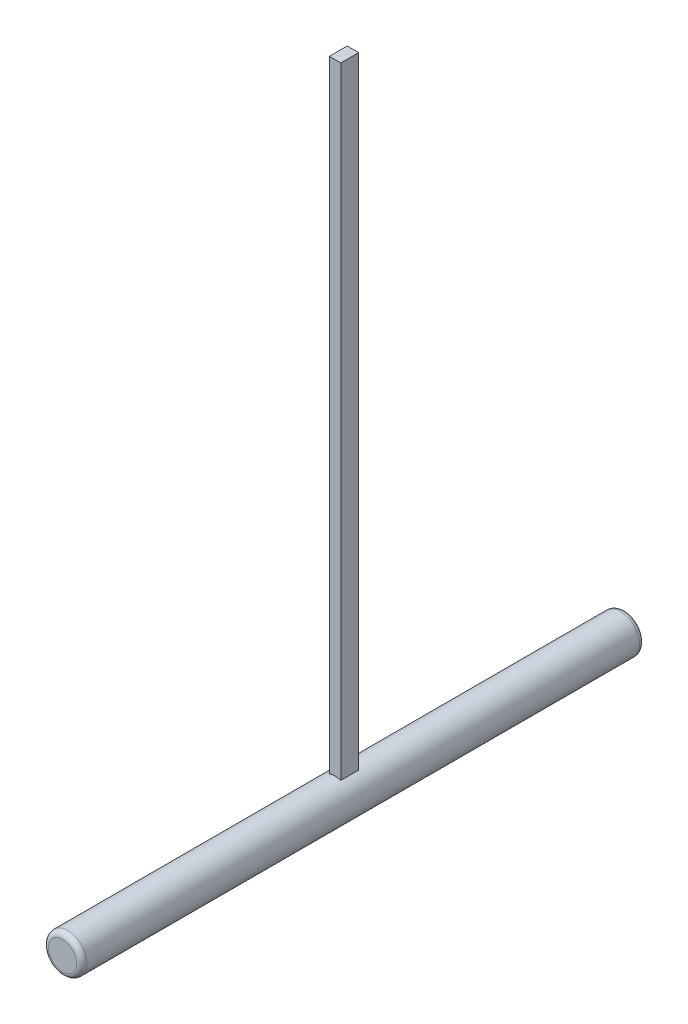
ISO-10303-21;
HEADER;
FILE_DESCRIPTION(('STEP AP214'),'2;1');
FILE_NAME('part.step','',(''),(''),'','','');
FILE_SCHEMA(('AUTOMOTIVE_DESIGN { 1 0 10303 214 1 1 1 1 }'));
ENDSEC;
DATA;
#1=APPLICATION_CONTEXT('core data for automotive mechanical design processes');
#2=APPLICATION_PROTOCOL_DEFINITION('international standard','automotive_design',2000,#1);
#3=PRODUCT_CONTEXT('',#1,'mechanical');
#4=PRODUCT('Part','Part','',(#3));
#5=PRODUCT_RELATED_PRODUCT_CATEGORY('part','',(#4));
#6=PRODUCT_DEFINITION_FORMATION('','',#4);
#7=PRODUCT_DEFINITION_CONTEXT('part definition',#1,'design');
#8=PRODUCT_DEFINITION('design','',#6,#7);
#9=PRODUCT_DEFINITION_SHAPE('','',#8);
#10=(LENGTH_UNIT() NAMED_UNIT(*) SI_UNIT(.MILLI.,.METRE.));
#11=(NAMED_UNIT(*) PLANE_ANGLE_UNIT() SI_UNIT($,.RADIAN.));
#12=(NAMED_UNIT(*) SI_UNIT($,.STERADIAN.) SOLID_ANGLE_UNIT());
#13=UNCERTAINTY_MEASURE_WITH_UNIT(LENGTH_MEASURE(1.E-05),#10,'distance_accuracy_value','');
#14=(GEOMETRIC_REPRESENTATION_CONTEXT(3) GLOBAL_UNCERTAINTY_ASSIGNED_CONTEXT((#13)) GLOBAL_UNIT_ASSIGNED_CONTEXT((#10,
#11,#12)) REPRESENTATION_CONTEXT('',''));
#15=CARTESIAN_POINT('',(0.,0.,0.));
#16=DIRECTION('',(0.,0.,1.));
#17=DIRECTION('',(1.,0.,0.));
#18=AXIS2_PLACEMENT_3D('',#15,#16,#17);
#19=CARTESIAN_POINT('',(0.,0.,220.));
#20=DIRECTION('',(0.,0.,-1.));
#21=DIRECTION('',(-1.,0.,0.));
#22=AXIS2_PLACEMENT_3D('',#19,#20,#21);
#23=CYLINDRICAL_SURFACE('',#22,7.5);
#24=DIRECTION('',(0.,0.,-1.));
#25=VECTOR('',#24,1.);
#26=CARTESIAN_POINT('',(-2.24499999999997,7.1561145183682,220.));
#27=LINE('',#26,#25);
#28=CARTESIAN_POINT('',(-2.24499999999998,7.1561145183682,106.505));
#29=VERTEX_POINT('',#28);
#30=CARTESIAN_POINT('',(-2.24499999999997,7.1561145183682,113.495));
#31=VERTEX_POINT('',#30);
#32=EDGE_CURVE('E123',#29,#31,#27,.F.);
#33=ORIENTED_EDGE('',*,*,#32,.F.);
#34=CARTESIAN_POINT('',(0.,0.,106.505));
#35=DIRECTION('',(0.,0.,-1.));
#36=DIRECTION('',(-1.,0.,0.));
#37=AXIS2_PLACEMENT_3D('',#34,#35,#36);
#38=CIRCLE('',#37,7.5);
#39=CARTESIAN_POINT('',(2.24500000000002,7.15611451836819,106.505));
#40=VERTEX_POINT('',#39);
#41=EDGE_CURVE('E115',#40,#29,#38,.F.);
#42=ORIENTED_EDGE('',*,*,#41,.F.);
#43=DIRECTION('',(0.,0.,-1.));
#44=VECTOR('',#43,1.);
#45=CARTESIAN_POINT('',(2.24500000000004,7.15611451836818,220.));
#46=LINE('',#45,#44);
#47=CARTESIAN_POINT('',(2.24500000000004,7.15611451836818,113.495));
#48=VERTEX_POINT('',#47);
#49=EDGE_CURVE('E62',#48,#40,#46,.T.);
#50=ORIENTED_EDGE('',*,*,#49,.F.);
#51=CARTESIAN_POINT('',(0.,0.,113.495));
#52=DIRECTION('',(0.,0.,1.));
#53=DIRECTION('',(1.,0.,0.));
#54=AXIS2_PLACEMENT_3D('',#51,#52,#53);
#55=CIRCLE('',#54,7.5);
#56=EDGE_CURVE('E55',#31,#48,#55,.F.);
#57=ORIENTED_EDGE('',*,*,#56,.F.);
#58=EDGE_LOOP('',(#33,#42,#50,#57));
#59=FACE_BOUND('',#58,.T.);
#60=CARTESIAN_POINT('',(0.,0.,2.));
#61=DIRECTION('',(0.,0.,1.));
#62=DIRECTION('',(1.,0.,0.));
#63=AXIS2_PLACEMENT_3D('',#60,#61,#62);
#64=CIRCLE('',#63,7.5);
#65=CARTESIAN_POINT('',(7.5,0.,2.));
#66=VERTEX_POINT('',#65);
#67=EDGE_CURVE('E128',#66,#66,#64,.T.);
#68=ORIENTED_EDGE('',*,*,#67,.T.);
#69=EDGE_LOOP('',(#68));
#70=FACE_BOUND('',#69,.T.);
#71=CARTESIAN_POINT('',(0.,0.,218.));
#72=DIRECTION('',(0.,0.,1.));
#73=DIRECTION('',(1.,0.,0.));
#74=AXIS2_PLACEMENT_3D('',#71,#72,#73);
#75=CIRCLE('',#74,7.5);
#76=CARTESIAN_POINT('',(7.5,0.,218.));
#77=VERTEX_POINT('',#76);
#78=EDGE_CURVE('E124',#77,#77,#75,.F.);
#79=ORIENTED_EDGE('',*,*,#78,.T.);
#80=EDGE_LOOP('',(#79));
#81=FACE_BOUND('',#80,.T.);
#82=ADVANCED_FACE('F39',(#59,#70,#81),#23,.T.);
#83=CARTESIAN_POINT('',(0.,0.,220.));
#84=DIRECTION('',(0.,0.,1.));
#85=DIRECTION('',(1.,0.,0.));
#86=AXIS2_PLACEMENT_3D('',#83,#84,#85);
#87=PLANE('',#86);
#88=CARTESIAN_POINT('',(0.,0.,220.));
#89=DIRECTION('',(0.,0.,1.));
#90=DIRECTION('',(1.,0.,0.));
#91=AXIS2_PLACEMENT_3D('',#88,#89,#90);
#92=CIRCLE('',#91,5.5);
#93=CARTESIAN_POINT('',(5.5,0.,220.));
#94=VERTEX_POINT('',#93);
#95=EDGE_CURVE('E11',#94,#94,#92,.T.);
#96=ORIENTED_EDGE('',*,*,#95,.T.);
#97=EDGE_LOOP('',(#96));
#98=FACE_BOUND('',#97,.T.);
#99=ADVANCED_FACE('F144',(#98),#87,.T.);
#100=CARTESIAN_POINT('',(0.,0.,0.));
#101=DIRECTION('',(0.,0.,1.));
#102=DIRECTION('',(1.,0.,0.));
#103=AXIS2_PLACEMENT_3D('',#100,#101,#102);
#104=PLANE('',#103);
#105=CARTESIAN_POINT('',(0.,0.,0.));
#106=DIRECTION('',(0.,0.,1.));
#107=DIRECTION('',(1.,0.,0.));
#108=AXIS2_PLACEMENT_3D('',#105,#106,#107);
#109=CIRCLE('',#108,5.5);
#110=CARTESIAN_POINT('',(5.5,0.,0.));
#111=VERTEX_POINT('',#110);
#112=EDGE_CURVE('E48',#111,#111,#109,.F.);
#113=ORIENTED_EDGE('',*,*,#112,.T.);
#114=EDGE_LOOP('',(#113));
#115=FACE_BOUND('',#114,.T.);
#116=ADVANCED_FACE('F135',(#115),#104,.F.);
#117=CARTESIAN_POINT('',(0.,0.,2.));
#118=DIRECTION('',(0.,0.,1.));
#119=DIRECTION('',(1.,0.,0.));
#120=AXIS2_PLACEMENT_3D('',#117,#118,#119);
#121=TOROIDAL_SURFACE('',#120,5.5,2.);
#122=ORIENTED_EDGE('',*,*,#112,.F.);
#123=EDGE_LOOP('',(#122));
#124=FACE_BOUND('',#123,.T.);
#125=ORIENTED_EDGE('',*,*,#67,.F.);
#126=EDGE_LOOP('',(#125));
#127=FACE_BOUND('',#126,.T.);
#128=ADVANCED_FACE('F137',(#124,#127),#121,.T.);
#129=CARTESIAN_POINT('',(0.,0.,218.));
#130=DIRECTION('',(0.,0.,1.));
#131=DIRECTION('',(1.,0.,0.));
#132=AXIS2_PLACEMENT_3D('',#129,#130,#131);
#133=TOROIDAL_SURFACE('',#132,5.5,2.);
#134=ORIENTED_EDGE('',*,*,#78,.F.);
#135=EDGE_LOOP('',(#134));
#136=FACE_BOUND('',#135,.T.);
#137=ORIENTED_EDGE('',*,*,#95,.F.);
#138=EDGE_LOOP('',(#137));
#139=FACE_BOUND('',#138,.T.);
#140=ADVANCED_FACE('F41',(#136,#139),#133,.T.);
#141=CARTESIAN_POINT('',(0.,250.,0.));
#142=DIRECTION('',(0.,1.,0.));
#143=DIRECTION('',(0.,0.,1.));
#144=AXIS2_PLACEMENT_3D('',#141,#142,#143);
#145=PLANE('',#144);
#146=DIRECTION('',(0.,0.,-1.));
#147=VECTOR('',#146,1.);
#148=CARTESIAN_POINT('',(2.24500000000002,250.,106.505));
#149=LINE('',#148,#147);
#150=CARTESIAN_POINT('',(2.24500000000002,250.,113.495));
#151=VERTEX_POINT('',#150);
#152=CARTESIAN_POINT('',(2.24500000000002,250.,106.505));
#153=VERTEX_POINT('',#152);
#154=EDGE_CURVE('E83',#151,#153,#149,.T.);
#155=ORIENTED_EDGE('',*,*,#154,.T.);
#156=DIRECTION('',(-1.,0.,0.));
#157=VECTOR('',#156,1.);
#158=CARTESIAN_POINT('',(-2.24499999999998,250.,106.505));
#159=LINE('',#158,#157);
#160=CARTESIAN_POINT('',(-2.24499999999998,250.,106.505));
#161=VERTEX_POINT('',#160);
#162=EDGE_CURVE('E93',#153,#161,#159,.T.);
#163=ORIENTED_EDGE('',*,*,#162,.T.);
#164=DIRECTION('',(0.,0.,1.));
#165=VECTOR('',#164,1.);
#166=CARTESIAN_POINT('',(-2.24499999999998,250.,106.505));
#167=LINE('',#166,#165);
#168=CARTESIAN_POINT('',(-2.24499999999998,250.,113.495));
#169=VERTEX_POINT('',#168);
#170=EDGE_CURVE('E99',#161,#169,#167,.T.);
#171=ORIENTED_EDGE('',*,*,#170,.T.);
#172=DIRECTION('',(1.,0.,0.));
#173=VECTOR('',#172,1.);
#174=CARTESIAN_POINT('',(-2.24499999999998,250.,113.495));
#175=LINE('',#174,#173);
#176=EDGE_CURVE('E90',#169,#151,#175,.T.);
#177=ORIENTED_EDGE('',*,*,#176,.T.);
#178=EDGE_LOOP('',(#155,#163,#171,#177));
#179=FACE_BOUND('',#178,.T.);
#180=ADVANCED_FACE('F101',(#179),#145,.T.);
#181=CARTESIAN_POINT('',(-2.24499999999998,-7.50099999999998,106.505));
#182=DIRECTION('',(0.,0.,-1.));
#183=DIRECTION('',(-1.,0.,0.));
#184=AXIS2_PLACEMENT_3D('',#181,#182,#183);
#185=PLANE('',#184);
#186=DIRECTION('',(0.,1.,0.));
#187=VECTOR('',#186,1.);
#188=CARTESIAN_POINT('',(2.24500000000002,-7.50099999999998,106.505));
#189=LINE('',#188,#187);
#190=EDGE_CURVE('E79',#40,#153,#189,.T.);
#191=ORIENTED_EDGE('',*,*,#190,.F.);
#192=ORIENTED_EDGE('',*,*,#41,.T.);
#193=DIRECTION('',(0.,1.,0.));
#194=VECTOR('',#193,1.);
#195=CARTESIAN_POINT('',(-2.24499999999998,-7.50099999999998,106.505));
#196=LINE('',#195,#194);
#197=EDGE_CURVE('E89',#29,#161,#196,.T.);
#198=ORIENTED_EDGE('',*,*,#197,.T.);
#199=ORIENTED_EDGE('',*,*,#162,.F.);
#200=EDGE_LOOP('',(#191,#192,#198,#199));
#201=FACE_BOUND('',#200,.T.);
#202=ADVANCED_FACE('F94',(#201),#185,.T.);
#203=CARTESIAN_POINT('',(-2.24499999999998,-7.50099999999998,106.505));
#204=DIRECTION('',(-1.,0.,0.));
#205=DIRECTION('',(0.,0.,1.));
#206=AXIS2_PLACEMENT_3D('',#203,#204,#205);
#207=PLANE('',#206);
#208=ORIENTED_EDGE('',*,*,#197,.F.);
#209=ORIENTED_EDGE('',*,*,#32,.T.);
#210=DIRECTION('',(0.,1.,0.));
#211=VECTOR('',#210,1.);
#212=CARTESIAN_POINT('',(-2.24499999999998,-7.50099999999998,113.495));
#213=LINE('',#212,#211);
#214=EDGE_CURVE('E116',#31,#169,#213,.T.);
#215=ORIENTED_EDGE('',*,*,#214,.T.);
#216=ORIENTED_EDGE('',*,*,#170,.F.);
#217=EDGE_LOOP('',(#208,#209,#215,#216));
#218=FACE_BOUND('',#217,.T.);
#219=ADVANCED_FACE('F165',(#218),#207,.T.);
#220=CARTESIAN_POINT('',(-2.24499999999998,-7.50099999999998,113.495));
#221=DIRECTION('',(0.,0.,1.));
#222=DIRECTION('',(1.,0.,0.));
#223=AXIS2_PLACEMENT_3D('',#220,#221,#222);
#224=PLANE('',#223);
#225=ORIENTED_EDGE('',*,*,#214,.F.);
#226=ORIENTED_EDGE('',*,*,#56,.T.);
#227=DIRECTION('',(0.,1.,0.));
#228=VECTOR('',#227,1.);
#229=CARTESIAN_POINT('',(2.24500000000002,-7.50099999999998,113.495));
#230=LINE('',#229,#228);
#231=EDGE_CURVE('E112',#48,#151,#230,.T.);
#232=ORIENTED_EDGE('',*,*,#231,.T.);
#233=ORIENTED_EDGE('',*,*,#176,.F.);
#234=EDGE_LOOP('',(#225,#226,#232,#233));
#235=FACE_BOUND('',#234,.T.);
#236=ADVANCED_FACE('F162',(#235),#224,.T.);
#237=CARTESIAN_POINT('',(2.24500000000002,-7.50099999999998,106.505));
#238=DIRECTION('',(1.,0.,0.));
#239=DIRECTION('',(0.,0.,-1.));
#240=AXIS2_PLACEMENT_3D('',#237,#238,#239);
#241=PLANE('',#240);
#242=ORIENTED_EDGE('',*,*,#231,.F.);
#243=ORIENTED_EDGE('',*,*,#49,.T.);
#244=ORIENTED_EDGE('',*,*,#190,.T.);
#245=ORIENTED_EDGE('',*,*,#154,.F.);
#246=EDGE_LOOP('',(#242,#243,#244,#245));
#247=FACE_BOUND('',#246,.T.);
#248=ADVANCED_FACE('F81',(#247),#241,.T.);
#249=CLOSED_SHELL('',(#82,#99,#116,#128,#140,#180,#202,#219,#236,#248));
#250=MANIFOLD_SOLID_BREP('B2',#249);
#251=ADVANCED_BREP_SHAPE_REPRESENTATION('',(#18,#250),#14);
#252=SHAPE_DEFINITION_REPRESENTATION(#9,#251);
ENDSEC;
END-ISO-10303-21;
